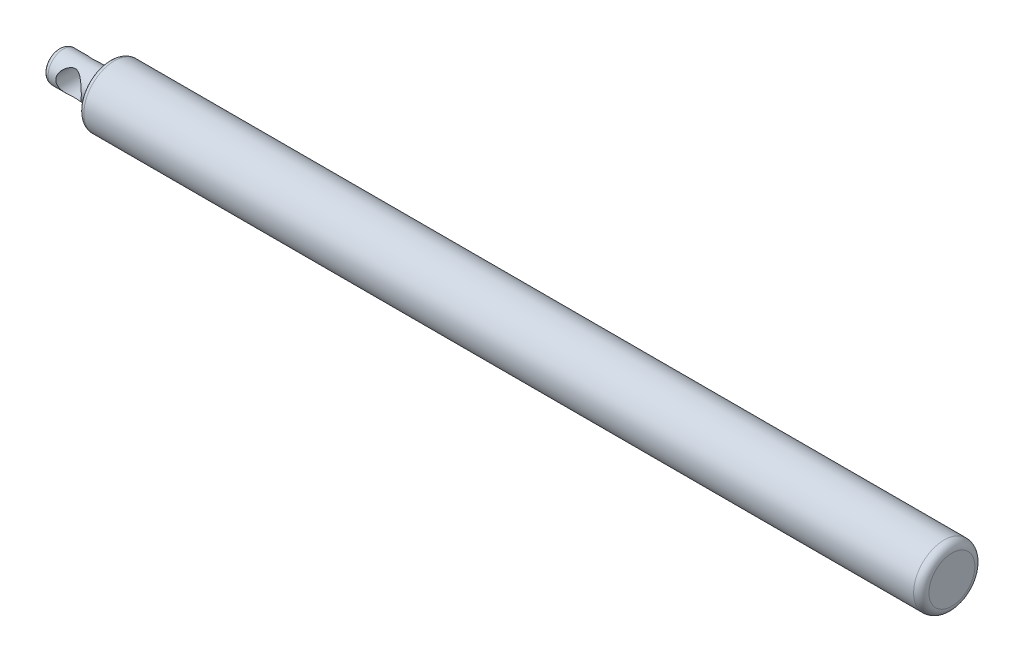
ISO-10303-21;
HEADER;
FILE_DESCRIPTION(('STEP AP214'),'2;1');
FILE_NAME('part.step','',(''),(''),'','','');
FILE_SCHEMA(('AUTOMOTIVE_DESIGN { 1 0 10303 214 1 1 1 1 }'));
ENDSEC;
DATA;
#1=APPLICATION_CONTEXT('core data for automotive mechanical design processes');
#2=APPLICATION_PROTOCOL_DEFINITION('international standard','automotive_design',2000,#1);
#3=PRODUCT_CONTEXT('',#1,'mechanical');
#4=PRODUCT('Part','Part','',(#3));
#5=PRODUCT_RELATED_PRODUCT_CATEGORY('part','',(#4));
#6=PRODUCT_DEFINITION_FORMATION('','',#4);
#7=PRODUCT_DEFINITION_CONTEXT('part definition',#1,'design');
#8=PRODUCT_DEFINITION('design','',#6,#7);
#9=PRODUCT_DEFINITION_SHAPE('','',#8);
#10=(LENGTH_UNIT() NAMED_UNIT(*) SI_UNIT(.MILLI.,.METRE.));
#11=(NAMED_UNIT(*) PLANE_ANGLE_UNIT() SI_UNIT($,.RADIAN.));
#12=(NAMED_UNIT(*) SI_UNIT($,.STERADIAN.) SOLID_ANGLE_UNIT());
#13=UNCERTAINTY_MEASURE_WITH_UNIT(LENGTH_MEASURE(1.E-05),#10,'distance_accuracy_value','');
#14=(GEOMETRIC_REPRESENTATION_CONTEXT(3) GLOBAL_UNCERTAINTY_ASSIGNED_CONTEXT((#13)) GLOBAL_UNIT_ASSIGNED_CONTEXT((#10,
#11,#12)) REPRESENTATION_CONTEXT('',''));
#15=CARTESIAN_POINT('',(0.,0.,0.));
#16=DIRECTION('',(0.,0.,1.));
#17=DIRECTION('',(1.,0.,0.));
#18=AXIS2_PLACEMENT_3D('',#15,#16,#17);
#19=CARTESIAN_POINT('',(0.,3.,0.));
#20=DIRECTION('',(1.,0.,0.));
#21=DIRECTION('',(0.,0.,-1.));
#22=AXIS2_PLACEMENT_3D('',#19,#20,#21);
#23=PLANE('',#22);
#24=CARTESIAN_POINT('',(0.,0.,0.));
#25=DIRECTION('',(1.,0.,0.));
#26=DIRECTION('',(0.,0.,-1.));
#27=AXIS2_PLACEMENT_3D('',#24,#25,#26);
#28=CIRCLE('',#27,2.);
#29=CARTESIAN_POINT('',(0.,0.,-2.));
#30=VERTEX_POINT('',#29);
#31=EDGE_CURVE('E61',#30,#30,#28,.F.);
#32=ORIENTED_EDGE('',*,*,#31,.T.);
#33=EDGE_LOOP('',(#32));
#34=FACE_BOUND('',#33,.T.);
#35=ADVANCED_FACE('F32',(#34),#23,.F.);
#36=CARTESIAN_POINT('',(0.,0.,0.));
#37=DIRECTION('',(-1.,0.,0.));
#38=DIRECTION('',(0.,0.,1.));
#39=AXIS2_PLACEMENT_3D('',#36,#37,#38);
#40=CYLINDRICAL_SURFACE('',#39,3.);
#41=CARTESIAN_POINT('',(9.,0.,0.));
#42=DIRECTION('',(1.,0.,0.));
#43=DIRECTION('',(0.,0.,-1.));
#44=AXIS2_PLACEMENT_3D('',#41,#42,#43);
#45=CIRCLE('',#44,3.);
#46=CARTESIAN_POINT('',(9.,0.,-3.));
#47=VERTEX_POINT('',#46);
#48=EDGE_CURVE('E55',#47,#47,#45,.F.);
#49=ORIENTED_EDGE('',*,*,#48,.T.);
#50=EDGE_LOOP('',(#49));
#51=FACE_BOUND('',#50,.T.);
#52=CARTESIAN_POINT('',(1.,0.,0.));
#53=DIRECTION('',(1.,0.,0.));
#54=DIRECTION('',(0.,0.,-1.));
#55=AXIS2_PLACEMENT_3D('',#52,#53,#54);
#56=CIRCLE('',#55,3.);
#57=CARTESIAN_POINT('',(1.,0.,-3.));
#58=VERTEX_POINT('',#57);
#59=EDGE_CURVE('E58',#58,#58,#56,.T.);
#60=ORIENTED_EDGE('',*,*,#59,.T.);
#61=EDGE_LOOP('',(#60));
#62=FACE_BOUND('',#61,.T.);
#63=CARTESIAN_POINT('',(7.5,0.,3.));
#64=CARTESIAN_POINT('',(7.49999511444632,-0.118757533193203,2.99999522795205));
#65=CARTESIAN_POINT('',(7.49147749609542,-0.237551281104128,2.99288670594742));
#66=CARTESIAN_POINT('',(7.45803727664816,-0.471182492492811,2.96510762868268));
#67=CARTESIAN_POINT('',(7.43310252602469,-0.586016959612417,2.94442702942007));
#68=CARTESIAN_POINT('',(7.36868788266729,-0.807829942407297,2.89142690238865));
#69=CARTESIAN_POINT('',(7.32929492564629,-0.914850920904902,2.8591769655007));
#70=CARTESIAN_POINT('',(7.23798295205742,-1.11984139043408,2.78529176182902));
#71=CARTESIAN_POINT('',(7.18605970332675,-1.21780780775233,2.74365332434936));
#72=CARTESIAN_POINT('',(7.05054625019184,-1.43789998519767,2.63674191529867));
#73=CARTESIAN_POINT('',(6.96232979581782,-1.5556821965722,2.56840549256191));
#74=CARTESIAN_POINT('',(6.76947567424863,-1.77202398328147,2.42422624777674));
#75=CARTESIAN_POINT('',(6.66479243075689,-1.87052845158605,2.34836281453276));
#76=CARTESIAN_POINT('',(6.49591572350891,-2.00437263805588,2.23294886313738));
#77=CARTESIAN_POINT('',(6.4370444238087,-2.04699726278816,2.19383679994997));
#78=CARTESIAN_POINT('',(6.3154943970395,-2.12715295529554,2.11620611809193));
#79=CARTESIAN_POINT('',(6.25281440512926,-2.16468231743739,2.07768770195023));
#80=CARTESIAN_POINT('',(6.12373267566439,-2.23441122570746,2.00250543288661));
#81=CARTESIAN_POINT('',(6.05734021527518,-2.26662332666226,1.96583735754651));
#82=CARTESIAN_POINT('',(5.92055371607161,-2.32553690612792,1.89577686630311));
#83=CARTESIAN_POINT('',(5.85016315265821,-2.3522430799868,1.86238167220904));
#84=CARTESIAN_POINT('',(5.6983329097999,-2.40193513934005,1.79791918980412));
#85=CARTESIAN_POINT('',(5.61647590727652,-2.42433807692598,1.76736311251003));
#86=CARTESIAN_POINT('',(5.4481102311869,-2.46101313675502,1.71593180556004));
#87=CARTESIAN_POINT('',(5.36161341338533,-2.47530499393792,1.69503310194197));
#88=CARTESIAN_POINT('',(5.18423459162055,-2.49481072799048,1.66620928968844));
#89=CARTESIAN_POINT('',(5.09331204092931,-2.49991205058667,1.65844510563093));
#90=CARTESIAN_POINT('',(4.91143738699724,-2.5000856937119,1.65818308531825));
#91=CARTESIAN_POINT('',(4.82048528338467,-2.49515788278404,1.6656854491694));
#92=CARTESIAN_POINT('',(4.63447528917289,-2.47505262029594,1.69541639464497));
#93=CARTESIAN_POINT('',(4.53970625428294,-2.45905577113332,1.71881932066467));
#94=CARTESIAN_POINT('',(4.35578901879783,-2.41742550503027,1.77688235738914));
#95=CARTESIAN_POINT('',(4.26666062928519,-2.39176011044289,1.81157977103024));
#96=CARTESIAN_POINT('',(4.11217292145891,-2.33816270346873,1.88002226126137));
#97=CARTESIAN_POINT('',(4.04568775758836,-2.31177513033566,1.91250316845439));
#98=CARTESIAN_POINT('',(3.91634919322008,-2.25404424958636,1.98021996661529));
#99=CARTESIAN_POINT('',(3.85349795213417,-2.22269803586306,2.01545746697785));
#100=CARTESIAN_POINT('',(3.67003315898033,-2.12149677560466,2.12342648109724));
#101=CARTESIAN_POINT('',(3.55458585239392,-2.04450664231777,2.19837696967438));
#102=CARTESIAN_POINT('',(3.33173303754566,-1.86765914501415,2.35079897952277));
#103=CARTESIAN_POINT('',(3.22506167600812,-1.76681805277629,2.42819792618944));
#104=CARTESIAN_POINT('',(3.0288876551826,-1.54484388336149,2.57509054043285));
#105=CARTESIAN_POINT('',(2.93934796694374,-1.42375565615774,2.64460112267364));
#106=CARTESIAN_POINT('',(2.80058516090146,-1.19411179169416,2.75428914126547));
#107=CARTESIAN_POINT('',(2.74685710181235,-1.08972732107278,2.79748350073995));
#108=CARTESIAN_POINT('',(2.65365725474467,-0.871071458330373,2.87307804019801));
#109=CARTESIAN_POINT('',(2.61417656841943,-0.75680629278077,2.90548495660805));
#110=CARTESIAN_POINT('',(2.5515827500678,-0.519954301215426,2.95709834265565));
#111=CARTESIAN_POINT('',(2.52859605334244,-0.397310923125315,2.97620280955844));
#112=CARTESIAN_POINT('',(2.50129076807282,-0.148559976923734,2.99891434528972));
#113=CARTESIAN_POINT('',(2.49695968914984,-0.0224547835240079,3.00253178304177));
#114=CARTESIAN_POINT('',(2.50666243944376,0.21331019945657,2.99444999039147));
#115=CARTESIAN_POINT('',(2.51855863871517,0.323130540835854,2.98453350716313));
#116=CARTESIAN_POINT('',(2.55626695021149,0.538644964400601,2.95325589460135));
#117=CARTESIAN_POINT('',(2.58208073171896,0.644338549989558,2.93189339242796));
#118=CARTESIAN_POINT('',(2.64662339545526,0.850565499199252,2.87889521546186));
#119=CARTESIAN_POINT('',(2.68552078944427,0.951010682223312,2.84712564891974));
#120=CARTESIAN_POINT('',(2.7743956323367,1.14365900898103,2.7753612473389));
#121=CARTESIAN_POINT('',(2.82437717699329,1.2358590883121,2.73536337221808));
#122=CARTESIAN_POINT('',(2.95843179534697,1.45067439735099,2.62975152158594));
#123=CARTESIAN_POINT('',(3.0477325832673,1.5683435954073,2.56070244234714));
#124=CARTESIAN_POINT('',(3.24284038265563,1.78428994740847,2.41522445403191));
#125=CARTESIAN_POINT('',(3.34869845535474,1.88250490855173,2.33877300422835));
#126=CARTESIAN_POINT('',(3.51941196792861,2.01573314784291,2.22269805598601));
#127=CARTESIAN_POINT('',(3.57889827297598,2.05811069143949,2.1834115173603));
#128=CARTESIAN_POINT('',(3.70172081603227,2.13771669597406,2.10553153817181));
#129=CARTESIAN_POINT('',(3.76505842766409,2.17494330406755,2.06693835133607));
#130=CARTESIAN_POINT('',(3.89548840391519,2.24398857026757,1.9917610848264));
#131=CARTESIAN_POINT('',(3.9625702245336,2.27582148781537,1.95517188634212));
#132=CARTESIAN_POINT('',(4.10079010449983,2.3338885673946,1.88547561448179));
#133=CARTESIAN_POINT('',(4.17192437041937,2.36012785984655,1.85236536450791));
#134=CARTESIAN_POINT('',(4.32427036835188,2.40837357148322,1.78925557416047));
#135=CARTESIAN_POINT('',(4.40583445107372,2.42988314318544,1.75970711786654));
#136=CARTESIAN_POINT('',(4.5734519539426,2.46482255689514,1.71043063887427));
#137=CARTESIAN_POINT('',(4.65949357132788,2.47827257713357,1.69067811225259));
#138=CARTESIAN_POINT('',(4.83563760741233,2.49617289535263,1.6641531597946));
#139=CARTESIAN_POINT('',(4.92577532975068,2.5005179918396,1.65753251048391));
#140=CARTESIAN_POINT('',(5.10585321278393,2.49938197104455,1.65924308630667));
#141=CARTESIAN_POINT('',(5.19579331512513,2.49389826274012,1.66757825402155));
#142=CARTESIAN_POINT('',(5.38167257539052,2.4726526384854,1.69892898735519));
#143=CARTESIAN_POINT('',(5.47723027053267,2.45585812550761,1.72341371023858));
#144=CARTESIAN_POINT('',(5.6625312960827,2.41250339675091,1.78358728037387));
#145=CARTESIAN_POINT('',(5.75225422870929,2.38591088285909,1.81931312531326));
#146=CARTESIAN_POINT('',(5.90778904135484,2.33050835844919,1.88952619366194));
#147=CARTESIAN_POINT('',(5.97474375923492,2.30325853049531,1.92277816627791));
#148=CARTESIAN_POINT('',(6.10494638642439,2.24370627018012,1.9919518523057));
#149=CARTESIAN_POINT('',(6.16819211099981,2.21140090020864,2.02787511150519));
#150=CARTESIAN_POINT('',(6.35272956134195,2.10716294428985,2.13775931167912));
#151=CARTESIAN_POINT('',(6.46874692499193,2.02793576743751,2.2137978016432));
#152=CARTESIAN_POINT('',(6.69200726129125,1.84629697567414,2.36772603763546));
#153=CARTESIAN_POINT('',(6.79854179403292,1.74293959593281,2.44552394429512));
#154=CARTESIAN_POINT('',(6.99386379953934,1.51553554935622,2.59256498427754));
#155=CARTESIAN_POINT('',(7.08269056587395,1.39153583663216,2.66182692543067));
#156=CARTESIAN_POINT('',(7.21831419672309,1.15855518141084,2.76942305781508));
#157=CARTESIAN_POINT('',(7.27003851021944,1.05399877947694,2.81112174006882));
#158=CARTESIAN_POINT('',(7.35921867023857,0.835439786054363,2.88361460666452));
#159=CARTESIAN_POINT('',(7.39669352409529,0.721450026753909,2.9144233132377));
#160=CARTESIAN_POINT('',(7.45018845582659,0.506620038886863,2.9585874590469));
#161=CARTESIAN_POINT('',(7.46877512222678,0.406845468761927,2.97402142398111));
#162=CARTESIAN_POINT('',(7.49368236823808,0.204722725654239,2.99472922794408));
#163=CARTESIAN_POINT('',(7.50000421158692,0.102374818922785,3.00000411373941));
#164=CARTESIAN_POINT('',(7.5,0.,3.));
#165=B_SPLINE_CURVE_WITH_KNOTS('',3,(#63,#64,#65,#66,#67,#68,#69,#70,#71,#72,#73,#74,#75,#76,
#77,#78,#79,#80,#81,#82,#83,#84,#85,#86,#87,#88,#89,#90,#91,#92,#93,#94,#95,#96,#97,#98,#99,
#100,#101,#102,#103,#104,#105,#106,#107,#108,#109,#110,#111,#112,#113,#114,#115,#116,#117,#118,
#119,#120,#121,#122,#123,#124,#125,#126,#127,#128,#129,#130,#131,#132,#133,#134,#135,#136,#137,
#138,#139,#140,#141,#142,#143,#144,#145,#146,#147,#148,#149,#150,#151,#152,#153,#154,#155,#156,
#157,#158,#159,#160,#161,#162,#163,#164),.UNSPECIFIED.,.T.,.F.,(4,2,2,2,2,2,2,2,2,2,2,2,2,2,2,2,
2,2,2,2,2,2,2,2,2,2,2,2,2,2,2,2,2,2,2,2,2,2,2,2,2,2,2,2,2,2,2,2,2,2,4),(0.,0.355841276815113,
0.711946191026961,1.06594405359551,1.42006164830116,1.90425178760126,2.38980643116775,
2.63722280423449,2.88472179650724,3.13162777943676,3.37832232674674,3.64812890035754,
3.91727616616869,4.18969776924974,4.46212294312047,4.75723524199721,5.05333228584568,
5.28870178855693,5.52420974868632,5.99549339358979,6.4913731054827,6.98616858956866,
7.36002155957575,7.73364063000475,8.1100939531972,8.4862951927436,8.81743460677926,
9.14861374669871,9.48423297747606,9.81997643164433,10.3065635514456,10.7946819775667,
11.0432812121088,11.2919696391639,11.5399899810636,11.787781852862,12.0551105531685,
12.3217671309317,12.5914881373799,12.8612802568452,13.1598101383752,13.4593330283462,
13.6977271411687,13.9362602949129,14.4135864576438,14.914300110886,15.413889999571,
15.7841228897598,16.1538601797496,16.4606444271243,16.7673970625124),.UNSPECIFIED.);
#166=CARTESIAN_POINT('',(7.5,0.,3.));
#167=VERTEX_POINT('',#166);
#168=EDGE_CURVE('E64',#167,#167,#165,.T.);
#169=ORIENTED_EDGE('',*,*,#168,.T.);
#170=EDGE_LOOP('',(#169));
#171=FACE_BOUND('',#170,.T.);
#172=CARTESIAN_POINT('',(7.5,0.,-3.));
#173=CARTESIAN_POINT('',(7.49999511444632,0.118757533193203,-2.99999522795205));
#174=CARTESIAN_POINT('',(7.49147749609542,0.237551281104127,-2.99288670594742));
#175=CARTESIAN_POINT('',(7.45803727664816,0.47118249249281,-2.96510762868268));
#176=CARTESIAN_POINT('',(7.43310252602469,0.586016959612417,-2.94442702942007));
#177=CARTESIAN_POINT('',(7.36868788266729,0.807829942407297,-2.89142690238865));
#178=CARTESIAN_POINT('',(7.32929492564629,0.914850920904901,-2.8591769655007));
#179=CARTESIAN_POINT('',(7.23798295205742,1.11984139043408,-2.78529176182903));
#180=CARTESIAN_POINT('',(7.18605970332675,1.21780780775233,-2.74365332434937));
#181=CARTESIAN_POINT('',(7.05054625019184,1.43789998519767,-2.63674191529867));
#182=CARTESIAN_POINT('',(6.96232979581782,1.5556821965722,-2.56840549256191));
#183=CARTESIAN_POINT('',(6.76947567424863,1.77202398328146,-2.42422624777674));
#184=CARTESIAN_POINT('',(6.66479243075689,1.87052845158604,-2.34836281453276));
#185=CARTESIAN_POINT('',(6.49591572350891,2.00437263805588,-2.23294886313738));
#186=CARTESIAN_POINT('',(6.4370444238087,2.04699726278815,-2.19383679994997));
#187=CARTESIAN_POINT('',(6.3154943970395,2.12715295529554,-2.11620611809194));
#188=CARTESIAN_POINT('',(6.25281440512926,2.16468231743739,-2.07768770195023));
#189=CARTESIAN_POINT('',(6.12373267566439,2.23441122570746,-2.00250543288661));
#190=CARTESIAN_POINT('',(6.05734021527519,2.26662332666226,-1.96583735754651));
#191=CARTESIAN_POINT('',(5.92055371607161,2.32553690612792,-1.89577686630312));
#192=CARTESIAN_POINT('',(5.85016315265821,2.3522430799868,-1.86238167220904));
#193=CARTESIAN_POINT('',(5.6983329097999,2.40193513934005,-1.79791918980412));
#194=CARTESIAN_POINT('',(5.61647590727652,2.42433807692598,-1.76736311251003));
#195=CARTESIAN_POINT('',(5.4481102311869,2.46101313675502,-1.71593180556004));
#196=CARTESIAN_POINT('',(5.36161341338533,2.47530499393792,-1.69503310194197));
#197=CARTESIAN_POINT('',(5.18423459162055,2.49481072799048,-1.66620928968844));
#198=CARTESIAN_POINT('',(5.09331204092931,2.49991205058667,-1.65844510563093));
#199=CARTESIAN_POINT('',(4.91143738699724,2.5000856937119,-1.65818308531825));
#200=CARTESIAN_POINT('',(4.82048528338467,2.49515788278404,-1.6656854491694));
#201=CARTESIAN_POINT('',(4.63447528917288,2.47505262029594,-1.69541639464497));
#202=CARTESIAN_POINT('',(4.53970625428294,2.45905577113332,-1.71881932066467));
#203=CARTESIAN_POINT('',(4.35578901879783,2.41742550503027,-1.77688235738914));
#204=CARTESIAN_POINT('',(4.26666062928518,2.39176011044289,-1.81157977103025));
#205=CARTESIAN_POINT('',(4.1121729214589,2.33816270346873,-1.88002226126137));
#206=CARTESIAN_POINT('',(4.04568775758835,2.31177513033566,-1.91250316845439));
#207=CARTESIAN_POINT('',(3.91634919322007,2.25404424958636,-1.98021996661529));
#208=CARTESIAN_POINT('',(3.85349795213416,2.22269803586306,-2.01545746697786));
#209=CARTESIAN_POINT('',(3.67003315898033,2.12149677560466,-2.12342648109725));
#210=CARTESIAN_POINT('',(3.55458585239392,2.04450664231777,-2.19837696967438));
#211=CARTESIAN_POINT('',(3.33173303754565,1.86765914501414,-2.35079897952278));
#212=CARTESIAN_POINT('',(3.22506167600811,1.76681805277628,-2.42819792618945));
#213=CARTESIAN_POINT('',(3.0288876551826,1.54484388336149,-2.57509054043285));
#214=CARTESIAN_POINT('',(2.93934796694374,1.42375565615773,-2.64460112267364));
#215=CARTESIAN_POINT('',(2.80058516090145,1.19411179169416,-2.75428914126547));
#216=CARTESIAN_POINT('',(2.74685710181235,1.08972732107277,-2.79748350073995));
#217=CARTESIAN_POINT('',(2.65365725474466,0.871071458330365,-2.87307804019801));
#218=CARTESIAN_POINT('',(2.61417656841943,0.756806292780762,-2.90548495660805));
#219=CARTESIAN_POINT('',(2.5515827500678,0.519954301215418,-2.95709834265565));
#220=CARTESIAN_POINT('',(2.52859605334244,0.397310923125307,-2.97620280955844));
#221=CARTESIAN_POINT('',(2.50129076807282,0.148559976923726,-2.99891434528972));
#222=CARTESIAN_POINT('',(2.49695968914984,0.0224547835240007,-3.00253178304177));
#223=CARTESIAN_POINT('',(2.50666243944376,-0.213310199456576,-2.99444999039147));
#224=CARTESIAN_POINT('',(2.51855863871517,-0.323130540835861,-2.98453350716313));
#225=CARTESIAN_POINT('',(2.55626695021149,-0.538644964400606,-2.95325589460135));
#226=CARTESIAN_POINT('',(2.58208073171896,-0.644338549989563,-2.93189339242796));
#227=CARTESIAN_POINT('',(2.64662339545526,-0.850565499199257,-2.87889521546186));
#228=CARTESIAN_POINT('',(2.68552078944427,-0.951010682223316,-2.84712564891974));
#229=CARTESIAN_POINT('',(2.7743956323367,-1.14365900898104,-2.77536124733889));
#230=CARTESIAN_POINT('',(2.82437717699329,-1.2358590883121,-2.73536337221808));
#231=CARTESIAN_POINT('',(2.95843179534697,-1.45067439735099,-2.62975152158594));
#232=CARTESIAN_POINT('',(3.0477325832673,-1.56834359540731,-2.56070244234714));
#233=CARTESIAN_POINT('',(3.24284038265563,-1.78428994740848,-2.41522445403191));
#234=CARTESIAN_POINT('',(3.34869845535475,-1.88250490855173,-2.33877300422835));
#235=CARTESIAN_POINT('',(3.51941196792862,-2.01573314784291,-2.222698055986));
#236=CARTESIAN_POINT('',(3.57889827297599,-2.05811069143949,-2.1834115173603));
#237=CARTESIAN_POINT('',(3.70172081603228,-2.13771669597406,-2.10553153817181));
#238=CARTESIAN_POINT('',(3.7650584276641,-2.17494330406755,-2.06693835133607));
#239=CARTESIAN_POINT('',(3.89548840391519,-2.24398857026757,-1.9917610848264));
#240=CARTESIAN_POINT('',(3.96257022453361,-2.27582148781538,-1.95517188634212));
#241=CARTESIAN_POINT('',(4.10079010449983,-2.3338885673946,-1.88547561448179));
#242=CARTESIAN_POINT('',(4.17192437041937,-2.36012785984655,-1.8523653645079));
#243=CARTESIAN_POINT('',(4.32427036835189,-2.40837357148322,-1.78925557416047));
#244=CARTESIAN_POINT('',(4.40583445107373,-2.42988314318544,-1.75970711786654));
#245=CARTESIAN_POINT('',(4.57345195394261,-2.46482255689514,-1.71043063887427));
#246=CARTESIAN_POINT('',(4.65949357132788,-2.47827257713357,-1.69067811225259));
#247=CARTESIAN_POINT('',(4.83563760741233,-2.49617289535263,-1.6641531597946));
#248=CARTESIAN_POINT('',(4.92577532975069,-2.5005179918396,-1.65753251048391));
#249=CARTESIAN_POINT('',(5.10585321278394,-2.49938197104455,-1.65924308630667));
#250=CARTESIAN_POINT('',(5.19579331512514,-2.49389826274012,-1.66757825402155));
#251=CARTESIAN_POINT('',(5.38167257539052,-2.4726526384854,-1.69892898735519));
#252=CARTESIAN_POINT('',(5.47723027053268,-2.45585812550761,-1.72341371023858));
#253=CARTESIAN_POINT('',(5.66253129608271,-2.41250339675091,-1.78358728037387));
#254=CARTESIAN_POINT('',(5.7522542287093,-2.38591088285909,-1.81931312531326));
#255=CARTESIAN_POINT('',(5.90778904135484,-2.33050835844919,-1.88952619366194));
#256=CARTESIAN_POINT('',(5.97474375923492,-2.30325853049531,-1.92277816627791));
#257=CARTESIAN_POINT('',(6.1049463864244,-2.24370627018012,-1.99195185230571));
#258=CARTESIAN_POINT('',(6.16819211099982,-2.21140090020864,-2.0278751115052));
#259=CARTESIAN_POINT('',(6.35272956134196,-2.10716294428985,-2.13775931167913));
#260=CARTESIAN_POINT('',(6.46874692499194,-2.02793576743751,-2.2137978016432));
#261=CARTESIAN_POINT('',(6.69200726129125,-1.84629697567414,-2.36772603763546));
#262=CARTESIAN_POINT('',(6.79854179403292,-1.7429395959328,-2.44552394429513));
#263=CARTESIAN_POINT('',(6.99386379953934,-1.51553554935621,-2.59256498427755));
#264=CARTESIAN_POINT('',(7.08269056587395,-1.39153583663215,-2.66182692543068));
#265=CARTESIAN_POINT('',(7.21831419672309,-1.15855518141083,-2.76942305781508));
#266=CARTESIAN_POINT('',(7.27003851021944,-1.05399877947693,-2.81112174006883));
#267=CARTESIAN_POINT('',(7.35921867023858,-0.835439786054355,-2.88361460666453));
#268=CARTESIAN_POINT('',(7.39669352409529,-0.721450026753902,-2.9144233132377));
#269=CARTESIAN_POINT('',(7.45018845582659,-0.506620038886856,-2.95858745904691));
#270=CARTESIAN_POINT('',(7.46877512222678,-0.406845468761922,-2.97402142398111));
#271=CARTESIAN_POINT('',(7.49368236823808,-0.204722725654236,-2.99472922794408));
#272=CARTESIAN_POINT('',(7.50000421158692,-0.102374818922784,-3.00000411373941));
#273=CARTESIAN_POINT('',(7.5,0.,-3.));
#274=B_SPLINE_CURVE_WITH_KNOTS('',3,(#172,#173,#174,#175,#176,#177,#178,#179,#180,#181,#182,
#183,#184,#185,#186,#187,#188,#189,#190,#191,#192,#193,#194,#195,#196,#197,#198,#199,#200,#201,
#202,#203,#204,#205,#206,#207,#208,#209,#210,#211,#212,#213,#214,#215,#216,#217,#218,#219,#220,
#221,#222,#223,#224,#225,#226,#227,#228,#229,#230,#231,#232,#233,#234,#235,#236,#237,#238,#239,
#240,#241,#242,#243,#244,#245,#246,#247,#248,#249,#250,#251,#252,#253,#254,#255,#256,#257,#258,
#259,#260,#261,#262,#263,#264,#265,#266,#267,#268,#269,#270,#271,#272,#273),.UNSPECIFIED.,.T.,
.F.,(4,2,2,2,2,2,2,2,2,2,2,2,2,2,2,2,2,2,2,2,2,2,2,2,2,2,2,2,2,2,2,2,2,2,2,2,2,2,2,2,2,2,2,2,2,
2,2,2,2,2,4),(0.,0.355841276815113,0.711946191026961,1.06594405359551,1.42006164830116,
1.90425178760126,2.38980643116775,2.63722280423449,2.88472179650724,3.13162777943676,
3.37832232674674,3.64812890035754,3.91727616616869,4.18969776924975,4.46212294312047,
4.75723524199722,5.05333228584568,5.28870178855694,5.52420974868633,5.9954933935898,
6.49137310548271,6.98616858956867,7.36002155957576,7.73364063000476,8.11009395319721,
8.48629519274361,8.81743460677926,9.14861374669872,9.48423297747607,9.81997643164434,
10.3065635514456,10.7946819775667,11.0432812121088,11.2919696391639,11.5399899810636,
11.787781852862,12.0551105531685,12.3217671309317,12.5914881373799,12.8612802568452,
13.1598101383752,13.4593330283462,13.6977271411687,13.9362602949129,14.4135864576438,
14.914300110886,15.413889999571,15.7841228897598,16.1538601797496,16.4606444271243,
16.7673970625124),.UNSPECIFIED.);
#275=CARTESIAN_POINT('',(7.5,0.,-3.));
#276=VERTEX_POINT('',#275);
#277=EDGE_CURVE('E72',#276,#276,#274,.T.);
#278=ORIENTED_EDGE('',*,*,#277,.T.);
#279=EDGE_LOOP('',(#278));
#280=FACE_BOUND('',#279,.T.);
#281=ADVANCED_FACE('F76',(#51,#62,#171,#280),#40,.T.);
#282=CARTESIAN_POINT('',(10.,3.,0.));
#283=DIRECTION('',(1.,0.,0.));
#284=DIRECTION('',(0.,0.,-1.));
#285=AXIS2_PLACEMENT_3D('',#282,#283,#284);
#286=PLANE('',#285);
#287=CARTESIAN_POINT('',(10.,0.,0.));
#288=DIRECTION('',(1.,0.,0.));
#289=DIRECTION('',(0.,0.,-1.));
#290=AXIS2_PLACEMENT_3D('',#287,#288,#289);
#291=CIRCLE('',#290,4.);
#292=CARTESIAN_POINT('',(10.,0.,-4.));
#293=VERTEX_POINT('',#292);
#294=EDGE_CURVE('E47',#293,#293,#291,.T.);
#295=ORIENTED_EDGE('',*,*,#294,.T.);
#296=EDGE_LOOP('',(#295));
#297=FACE_BOUND('',#296,.T.);
#298=CARTESIAN_POINT('',(10.,0.,0.));
#299=DIRECTION('',(1.,0.,0.));
#300=DIRECTION('',(0.,0.,-1.));
#301=AXIS2_PLACEMENT_3D('',#298,#299,#300);
#302=CIRCLE('',#301,5.);
#303=CARTESIAN_POINT('',(10.,0.,-5.));
#304=VERTEX_POINT('',#303);
#305=EDGE_CURVE('E52',#304,#304,#302,.F.);
#306=ORIENTED_EDGE('',*,*,#305,.T.);
#307=EDGE_LOOP('',(#306));
#308=FACE_BOUND('',#307,.T.);
#309=ADVANCED_FACE('F92',(#297,#308),#286,.F.);
#310=CARTESIAN_POINT('',(0.,0.,0.));
#311=DIRECTION('',(-1.,0.,0.));
#312=DIRECTION('',(0.,0.,1.));
#313=AXIS2_PLACEMENT_3D('',#310,#311,#312);
#314=CYLINDRICAL_SURFACE('',#313,6.);
#315=CARTESIAN_POINT('',(173.5,0.,0.));
#316=DIRECTION('',(-1.,0.,0.));
#317=DIRECTION('',(0.,0.,1.));
#318=AXIS2_PLACEMENT_3D('',#315,#316,#317);
#319=CIRCLE('',#318,6.);
#320=CARTESIAN_POINT('',(173.5,0.,6.));
#321=VERTEX_POINT('',#320);
#322=EDGE_CURVE('E39',#321,#321,#319,.T.);
#323=ORIENTED_EDGE('',*,*,#322,.T.);
#324=EDGE_LOOP('',(#323));
#325=FACE_BOUND('',#324,.T.);
#326=CARTESIAN_POINT('',(11.,0.,0.));
#327=DIRECTION('',(1.,0.,0.));
#328=DIRECTION('',(0.,0.,-1.));
#329=AXIS2_PLACEMENT_3D('',#326,#327,#328);
#330=CIRCLE('',#329,6.);
#331=CARTESIAN_POINT('',(11.,0.,-6.));
#332=VERTEX_POINT('',#331);
#333=EDGE_CURVE('E43',#332,#332,#330,.T.);
#334=ORIENTED_EDGE('',*,*,#333,.T.);
#335=EDGE_LOOP('',(#334));
#336=FACE_BOUND('',#335,.T.);
#337=ADVANCED_FACE('F90',(#325,#336),#314,.T.);
#338=CARTESIAN_POINT('',(175.,6.,0.));
#339=DIRECTION('',(-1.,0.,0.));
#340=DIRECTION('',(0.,0.,1.));
#341=AXIS2_PLACEMENT_3D('',#338,#339,#340);
#342=PLANE('',#341);
#343=CARTESIAN_POINT('',(175.,0.,0.));
#344=DIRECTION('',(-1.,0.,0.));
#345=DIRECTION('',(0.,0.,1.));
#346=AXIS2_PLACEMENT_3D('',#343,#344,#345);
#347=CIRCLE('',#346,4.5);
#348=CARTESIAN_POINT('',(175.,0.,4.5));
#349=VERTEX_POINT('',#348);
#350=EDGE_CURVE('E10',#349,#349,#347,.F.);
#351=ORIENTED_EDGE('',*,*,#350,.T.);
#352=EDGE_LOOP('',(#351));
#353=FACE_BOUND('',#352,.T.);
#354=ADVANCED_FACE('F85',(#353),#342,.F.);
#355=CARTESIAN_POINT('',(5.,0.,-6.));
#356=DIRECTION('',(0.,0.,1.));
#357=DIRECTION('',(1.,0.,0.));
#358=AXIS2_PLACEMENT_3D('',#355,#356,#357);
#359=CYLINDRICAL_SURFACE('',#358,2.5);
#360=ORIENTED_EDGE('',*,*,#277,.F.);
#361=EDGE_LOOP('',(#360));
#362=FACE_BOUND('',#361,.T.);
#363=ORIENTED_EDGE('',*,*,#168,.F.);
#364=EDGE_LOOP('',(#363));
#365=FACE_BOUND('',#364,.T.);
#366=ADVANCED_FACE('F80',(#362,#365),#359,.F.);
#367=CARTESIAN_POINT('',(1.,0.,0.));
#368=DIRECTION('',(1.,0.,0.));
#369=DIRECTION('',(0.,0.,-1.));
#370=AXIS2_PLACEMENT_3D('',#367,#368,#369);
#371=TOROIDAL_SURFACE('',#370,2.,1.);
#372=ORIENTED_EDGE('',*,*,#59,.F.);
#373=EDGE_LOOP('',(#372));
#374=FACE_BOUND('',#373,.T.);
#375=ORIENTED_EDGE('',*,*,#31,.F.);
#376=EDGE_LOOP('',(#375));
#377=FACE_BOUND('',#376,.T.);
#378=ADVANCED_FACE('F84',(#374,#377),#371,.T.);
#379=CARTESIAN_POINT('',(9.,0.,0.));
#380=DIRECTION('',(1.,0.,0.));
#381=DIRECTION('',(0.,0.,-1.));
#382=AXIS2_PLACEMENT_3D('',#379,#380,#381);
#383=TOROIDAL_SURFACE('',#382,4.,1.);
#384=ORIENTED_EDGE('',*,*,#294,.F.);
#385=EDGE_LOOP('',(#384));
#386=FACE_BOUND('',#385,.T.);
#387=ORIENTED_EDGE('',*,*,#48,.F.);
#388=EDGE_LOOP('',(#387));
#389=FACE_BOUND('',#388,.T.);
#390=ADVANCED_FACE('F107',(#386,#389),#383,.F.);
#391=CARTESIAN_POINT('',(11.,0.,0.));
#392=DIRECTION('',(1.,0.,0.));
#393=DIRECTION('',(0.,0.,-1.));
#394=AXIS2_PLACEMENT_3D('',#391,#392,#393);
#395=TOROIDAL_SURFACE('',#394,5.,1.);
#396=ORIENTED_EDGE('',*,*,#333,.F.);
#397=EDGE_LOOP('',(#396));
#398=FACE_BOUND('',#397,.T.);
#399=ORIENTED_EDGE('',*,*,#305,.F.);
#400=EDGE_LOOP('',(#399));
#401=FACE_BOUND('',#400,.T.);
#402=ADVANCED_FACE('F110',(#398,#401),#395,.T.);
#403=CARTESIAN_POINT('',(173.5,0.,0.));
#404=DIRECTION('',(-1.,0.,0.));
#405=DIRECTION('',(0.,0.,1.));
#406=AXIS2_PLACEMENT_3D('',#403,#404,#405);
#407=TOROIDAL_SURFACE('',#406,4.5,1.5);
#408=ORIENTED_EDGE('',*,*,#350,.F.);
#409=EDGE_LOOP('',(#408));
#410=FACE_BOUND('',#409,.T.);
#411=ORIENTED_EDGE('',*,*,#322,.F.);
#412=EDGE_LOOP('',(#411));
#413=FACE_BOUND('',#412,.T.);
#414=ADVANCED_FACE('F34',(#410,#413),#407,.T.);
#415=CLOSED_SHELL('',(#35,#281,#309,#337,#354,#366,#378,#390,#402,#414));
#416=MANIFOLD_SOLID_BREP('B2',#415);
#417=ADVANCED_BREP_SHAPE_REPRESENTATION('',(#18,#416),#14);
#418=SHAPE_DEFINITION_REPRESENTATION(#9,#417);
ENDSEC;
END-ISO-10303-21;
